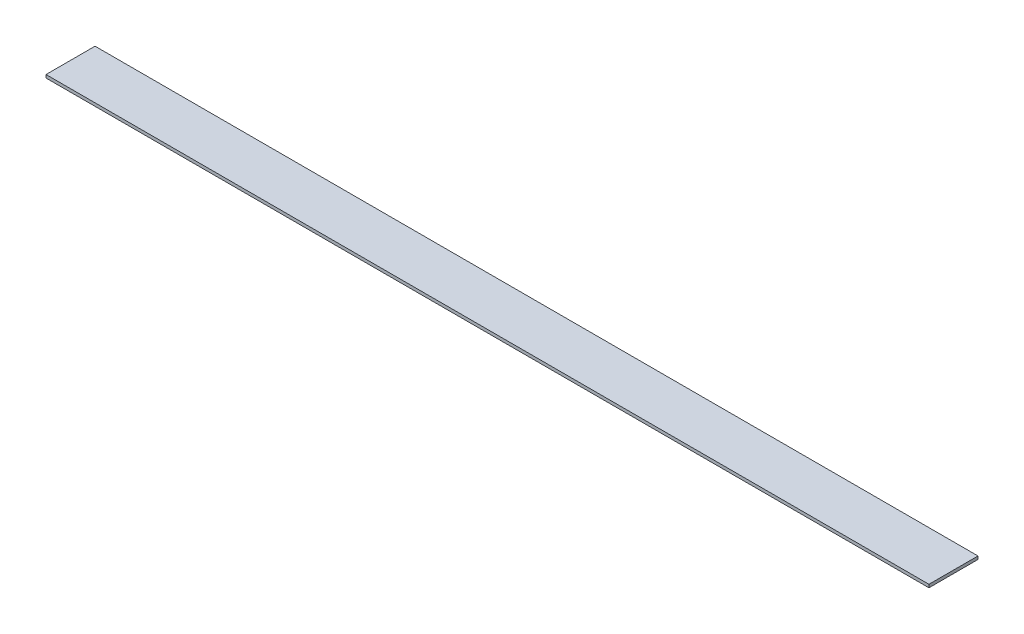
ISO-10303-21;
HEADER;
FILE_DESCRIPTION(('STEP AP214'),'2;1');
FILE_NAME('part.step','',(''),(''),'','','');
FILE_SCHEMA(('AUTOMOTIVE_DESIGN { 1 0 10303 214 1 1 1 1 }'));
ENDSEC;
DATA;
#1=APPLICATION_CONTEXT('core data for automotive mechanical design processes');
#2=APPLICATION_PROTOCOL_DEFINITION('international standard','automotive_design',2000,#1);
#3=PRODUCT_CONTEXT('',#1,'mechanical');
#4=PRODUCT('Part','Part','',(#3));
#5=PRODUCT_RELATED_PRODUCT_CATEGORY('part','',(#4));
#6=PRODUCT_DEFINITION_FORMATION('','',#4);
#7=PRODUCT_DEFINITION_CONTEXT('part definition',#1,'design');
#8=PRODUCT_DEFINITION('design','',#6,#7);
#9=PRODUCT_DEFINITION_SHAPE('','',#8);
#10=(LENGTH_UNIT() NAMED_UNIT(*) SI_UNIT(.MILLI.,.METRE.));
#11=(NAMED_UNIT(*) PLANE_ANGLE_UNIT() SI_UNIT($,.RADIAN.));
#12=(NAMED_UNIT(*) SI_UNIT($,.STERADIAN.) SOLID_ANGLE_UNIT());
#13=UNCERTAINTY_MEASURE_WITH_UNIT(LENGTH_MEASURE(1.E-05),#10,'distance_accuracy_value','');
#14=(GEOMETRIC_REPRESENTATION_CONTEXT(3) GLOBAL_UNCERTAINTY_ASSIGNED_CONTEXT((#13)) GLOBAL_UNIT_ASSIGNED_CONTEXT((#10,
#11,#12)) REPRESENTATION_CONTEXT('',''));
#15=CARTESIAN_POINT('',(0.,0.,0.));
#16=DIRECTION('',(0.,0.,1.));
#17=DIRECTION('',(1.,0.,0.));
#18=AXIS2_PLACEMENT_3D('',#15,#16,#17);
#19=CARTESIAN_POINT('',(0.,1.5875,0.));
#20=DIRECTION('',(1.,0.,0.));
#21=DIRECTION('',(0.,0.,-1.));
#22=AXIS2_PLACEMENT_3D('',#19,#20,#21);
#23=PLANE('',#22);
#24=DIRECTION('',(0.,0.,1.));
#25=VECTOR('',#24,1.);
#26=CARTESIAN_POINT('',(0.,0.,0.));
#27=LINE('',#26,#25);
#28=CARTESIAN_POINT('',(0.,0.,-25.4));
#29=VERTEX_POINT('',#28);
#30=CARTESIAN_POINT('',(0.,0.,0.));
#31=VERTEX_POINT('',#30);
#32=EDGE_CURVE('E96',#29,#31,#27,.T.);
#33=ORIENTED_EDGE('',*,*,#32,.T.);
#34=DIRECTION('',(0.,-1.,0.));
#35=VECTOR('',#34,1.);
#36=CARTESIAN_POINT('',(0.,1.5875,0.));
#37=LINE('',#36,#35);
#38=CARTESIAN_POINT('',(0.,1.5875,0.));
#39=VERTEX_POINT('',#38);
#40=EDGE_CURVE('E11',#39,#31,#37,.T.);
#41=ORIENTED_EDGE('',*,*,#40,.F.);
#42=DIRECTION('',(0.,0.,1.));
#43=VECTOR('',#42,1.);
#44=CARTESIAN_POINT('',(0.,1.5875,0.));
#45=LINE('',#44,#43);
#46=CARTESIAN_POINT('',(0.,1.5875,-25.4));
#47=VERTEX_POINT('',#46);
#48=EDGE_CURVE('E84',#47,#39,#45,.T.);
#49=ORIENTED_EDGE('',*,*,#48,.F.);
#50=DIRECTION('',(0.,-1.,0.));
#51=VECTOR('',#50,1.);
#52=CARTESIAN_POINT('',(0.,1.5875,-25.4));
#53=LINE('',#52,#51);
#54=EDGE_CURVE('E92',#47,#29,#53,.T.);
#55=ORIENTED_EDGE('',*,*,#54,.T.);
#56=EDGE_LOOP('',(#33,#41,#49,#55));
#57=FACE_BOUND('',#56,.T.);
#58=ADVANCED_FACE('F33',(#57),#23,.F.);
#59=CARTESIAN_POINT('',(0.,1.5875,0.));
#60=DIRECTION('',(0.,0.,-1.));
#61=DIRECTION('',(-1.,0.,0.));
#62=AXIS2_PLACEMENT_3D('',#59,#60,#61);
#63=PLANE('',#62);
#64=DIRECTION('',(1.,0.,0.));
#65=VECTOR('',#64,1.);
#66=CARTESIAN_POINT('',(0.,0.,0.));
#67=LINE('',#66,#65);
#68=CARTESIAN_POINT('',(457.2,0.,0.));
#69=VERTEX_POINT('',#68);
#70=EDGE_CURVE('E88',#31,#69,#67,.T.);
#71=ORIENTED_EDGE('',*,*,#70,.T.);
#72=DIRECTION('',(0.,-1.,0.));
#73=VECTOR('',#72,1.);
#74=CARTESIAN_POINT('',(457.2,1.5875,0.));
#75=LINE('',#74,#73);
#76=CARTESIAN_POINT('',(457.2,1.5875,0.));
#77=VERTEX_POINT('',#76);
#78=EDGE_CURVE('E41',#77,#69,#75,.T.);
#79=ORIENTED_EDGE('',*,*,#78,.F.);
#80=DIRECTION('',(1.,0.,0.));
#81=VECTOR('',#80,1.);
#82=CARTESIAN_POINT('',(0.,1.5875,0.));
#83=LINE('',#82,#81);
#84=EDGE_CURVE('E79',#39,#77,#83,.T.);
#85=ORIENTED_EDGE('',*,*,#84,.F.);
#86=ORIENTED_EDGE('',*,*,#40,.T.);
#87=EDGE_LOOP('',(#71,#79,#85,#86));
#88=FACE_BOUND('',#87,.T.);
#89=ADVANCED_FACE('F87',(#88),#63,.F.);
#90=CARTESIAN_POINT('',(457.2,1.5875,0.));
#91=DIRECTION('',(-1.,0.,0.));
#92=DIRECTION('',(0.,0.,1.));
#93=AXIS2_PLACEMENT_3D('',#90,#91,#92);
#94=PLANE('',#93);
#95=DIRECTION('',(0.,0.,-1.));
#96=VECTOR('',#95,1.);
#97=CARTESIAN_POINT('',(457.2,0.,0.));
#98=LINE('',#97,#96);
#99=CARTESIAN_POINT('',(457.2,0.,-25.4));
#100=VERTEX_POINT('',#99);
#101=EDGE_CURVE('E66',#69,#100,#98,.T.);
#102=ORIENTED_EDGE('',*,*,#101,.T.);
#103=DIRECTION('',(0.,-1.,0.));
#104=VECTOR('',#103,1.);
#105=CARTESIAN_POINT('',(457.2,1.5875,-25.4));
#106=LINE('',#105,#104);
#107=CARTESIAN_POINT('',(457.2,1.5875,-25.4));
#108=VERTEX_POINT('',#107);
#109=EDGE_CURVE('E89',#108,#100,#106,.T.);
#110=ORIENTED_EDGE('',*,*,#109,.F.);
#111=DIRECTION('',(0.,0.,-1.));
#112=VECTOR('',#111,1.);
#113=CARTESIAN_POINT('',(457.2,1.5875,0.));
#114=LINE('',#113,#112);
#115=EDGE_CURVE('E82',#77,#108,#114,.T.);
#116=ORIENTED_EDGE('',*,*,#115,.F.);
#117=ORIENTED_EDGE('',*,*,#78,.T.);
#118=EDGE_LOOP('',(#102,#110,#116,#117));
#119=FACE_BOUND('',#118,.T.);
#120=ADVANCED_FACE('F90',(#119),#94,.F.);
#121=CARTESIAN_POINT('',(0.,1.5875,-25.4));
#122=DIRECTION('',(0.,0.,1.));
#123=DIRECTION('',(1.,0.,0.));
#124=AXIS2_PLACEMENT_3D('',#121,#122,#123);
#125=PLANE('',#124);
#126=DIRECTION('',(-1.,0.,0.));
#127=VECTOR('',#126,1.);
#128=CARTESIAN_POINT('',(0.,0.,-25.4));
#129=LINE('',#128,#127);
#130=EDGE_CURVE('E72',#100,#29,#129,.T.);
#131=ORIENTED_EDGE('',*,*,#130,.T.);
#132=ORIENTED_EDGE('',*,*,#54,.F.);
#133=DIRECTION('',(-1.,0.,0.));
#134=VECTOR('',#133,1.);
#135=CARTESIAN_POINT('',(0.,1.5875,-25.4));
#136=LINE('',#135,#134);
#137=EDGE_CURVE('E49',#108,#47,#136,.T.);
#138=ORIENTED_EDGE('',*,*,#137,.F.);
#139=ORIENTED_EDGE('',*,*,#109,.T.);
#140=EDGE_LOOP('',(#131,#132,#138,#139));
#141=FACE_BOUND('',#140,.T.);
#142=ADVANCED_FACE('F103',(#141),#125,.F.);
#143=CARTESIAN_POINT('',(0.,1.5875,0.));
#144=DIRECTION('',(0.,-1.,0.));
#145=DIRECTION('',(0.,0.,-1.));
#146=AXIS2_PLACEMENT_3D('',#143,#144,#145);
#147=PLANE('',#146);
#148=ORIENTED_EDGE('',*,*,#48,.T.);
#149=ORIENTED_EDGE('',*,*,#84,.T.);
#150=ORIENTED_EDGE('',*,*,#115,.T.);
#151=ORIENTED_EDGE('',*,*,#137,.T.);
#152=EDGE_LOOP('',(#148,#149,#150,#151));
#153=FACE_BOUND('',#152,.T.);
#154=ADVANCED_FACE('F80',(#153),#147,.F.);
#155=CARTESIAN_POINT('',(0.,0.,0.));
#156=DIRECTION('',(0.,-1.,0.));
#157=DIRECTION('',(0.,0.,-1.));
#158=AXIS2_PLACEMENT_3D('',#155,#156,#157);
#159=PLANE('',#158);
#160=ORIENTED_EDGE('',*,*,#32,.F.);
#161=ORIENTED_EDGE('',*,*,#130,.F.);
#162=ORIENTED_EDGE('',*,*,#101,.F.);
#163=ORIENTED_EDGE('',*,*,#70,.F.);
#164=EDGE_LOOP('',(#160,#161,#162,#163));
#165=FACE_BOUND('',#164,.T.);
#166=ADVANCED_FACE('F106',(#165),#159,.T.);
#167=CLOSED_SHELL('',(#58,#89,#120,#142,#154,#166));
#168=MANIFOLD_SOLID_BREP('B2',#167);
#169=ADVANCED_BREP_SHAPE_REPRESENTATION('',(#18,#168),#14);
#170=SHAPE_DEFINITION_REPRESENTATION(#9,#169);
ENDSEC;
END-ISO-10303-21;
